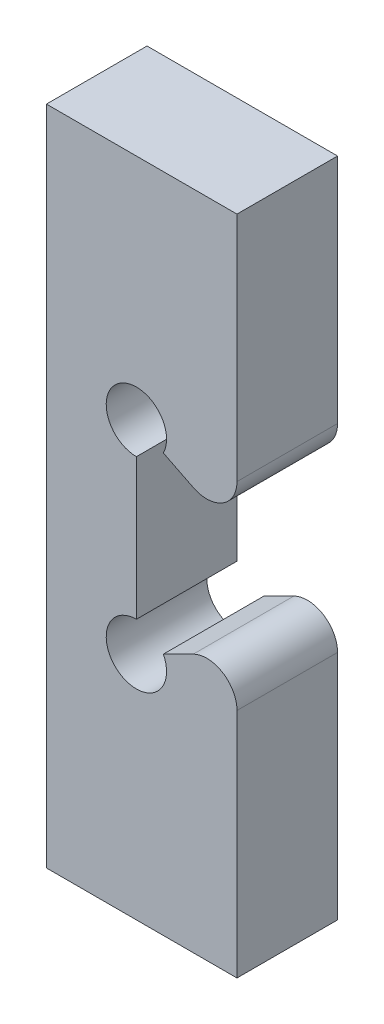
ISO-10303-21;
HEADER;
FILE_DESCRIPTION(('STEP AP214'),'2;1');
FILE_NAME('part.step','',(''),(''),'','','');
FILE_SCHEMA(('AUTOMOTIVE_DESIGN { 1 0 10303 214 1 1 1 1 }'));
ENDSEC;
DATA;
#1=APPLICATION_CONTEXT('core data for automotive mechanical design processes');
#2=APPLICATION_PROTOCOL_DEFINITION('international standard','automotive_design',2000,#1);
#3=PRODUCT_CONTEXT('',#1,'mechanical');
#4=PRODUCT('Part','Part','',(#3));
#5=PRODUCT_RELATED_PRODUCT_CATEGORY('part','',(#4));
#6=PRODUCT_DEFINITION_FORMATION('','',#4);
#7=PRODUCT_DEFINITION_CONTEXT('part definition',#1,'design');
#8=PRODUCT_DEFINITION('design','',#6,#7);
#9=PRODUCT_DEFINITION_SHAPE('','',#8);
#10=(LENGTH_UNIT() NAMED_UNIT(*) SI_UNIT(.MILLI.,.METRE.));
#11=(NAMED_UNIT(*) PLANE_ANGLE_UNIT() SI_UNIT($,.RADIAN.));
#12=(NAMED_UNIT(*) SI_UNIT($,.STERADIAN.) SOLID_ANGLE_UNIT());
#13=UNCERTAINTY_MEASURE_WITH_UNIT(LENGTH_MEASURE(1.E-05),#10,'distance_accuracy_value','');
#14=(GEOMETRIC_REPRESENTATION_CONTEXT(3) GLOBAL_UNCERTAINTY_ASSIGNED_CONTEXT((#13)) GLOBAL_UNIT_ASSIGNED_CONTEXT((#10,
#11,#12)) REPRESENTATION_CONTEXT('',''));
#15=CARTESIAN_POINT('',(0.,0.,0.));
#16=DIRECTION('',(0.,0.,1.));
#17=DIRECTION('',(1.,0.,0.));
#18=AXIS2_PLACEMENT_3D('',#15,#16,#17);
#19=CARTESIAN_POINT('',(-69.,4.15760929328095,-39.2215193998031));
#20=DIRECTION('',(0.,0.,1.));
#21=DIRECTION('',(1.,0.,0.));
#22=AXIS2_PLACEMENT_3D('',#19,#20,#21);
#23=CYLINDRICAL_SURFACE('',#22,1.5);
#24=CARTESIAN_POINT('',(-69.,4.15760929328095,-5.));
#25=DIRECTION('',(0.,0.,1.));
#26=DIRECTION('',(1.,0.,0.));
#27=AXIS2_PLACEMENT_3D('',#24,#25,#26);
#28=CIRCLE('',#27,1.5);
#29=CARTESIAN_POINT('',(-69.,5.65760929328095,-5.));
#30=VERTEX_POINT('',#29);
#31=CARTESIAN_POINT('',(-67.6583592135001,4.82842968653089,-5.));
#32=VERTEX_POINT('',#31);
#33=EDGE_CURVE('E46',#30,#32,#28,.T.);
#34=ORIENTED_EDGE('',*,*,#33,.F.);
#35=DIRECTION('',(0.,0.,1.));
#36=VECTOR('',#35,1.);
#37=CARTESIAN_POINT('',(-69.,5.65760929328095,-39.2215193998031));
#38=LINE('',#37,#36);
#39=CARTESIAN_POINT('',(-69.,5.65760929328095,0.));
#40=VERTEX_POINT('',#39);
#41=EDGE_CURVE('E125',#30,#40,#38,.T.);
#42=ORIENTED_EDGE('',*,*,#41,.T.);
#43=CARTESIAN_POINT('',(-69.,4.15760929328095,0.));
#44=DIRECTION('',(0.,0.,-1.));
#45=DIRECTION('',(1.,0.,0.));
#46=AXIS2_PLACEMENT_3D('',#43,#44,#45);
#47=CIRCLE('',#46,1.5);
#48=CARTESIAN_POINT('',(-67.6583592135001,4.82842968653089,0.));
#49=VERTEX_POINT('',#48);
#50=EDGE_CURVE('E129',#49,#40,#47,.T.);
#51=ORIENTED_EDGE('',*,*,#50,.F.);
#52=DIRECTION('',(0.,0.,1.));
#53=VECTOR('',#52,1.);
#54=CARTESIAN_POINT('',(-67.6583592135001,4.82842968653089,-39.2215193998031));
#55=LINE('',#54,#53);
#56=EDGE_CURVE('E176',#32,#49,#55,.T.);
#57=ORIENTED_EDGE('',*,*,#56,.F.);
#58=EDGE_LOOP('',(#34,#42,#51,#57));
#59=FACE_BOUND('',#58,.T.);
#60=ADVANCED_FACE('F39',(#59),#23,.F.);
#61=CARTESIAN_POINT('',(-67.6583592135001,4.82842968653089,-39.2215193998031));
#62=DIRECTION('',(-0.447213595499957,0.894427190999916,0.));
#63=DIRECTION('',(-0.894427190999916,-0.447213595499957,0.));
#64=AXIS2_PLACEMENT_3D('',#61,#62,#63);
#65=PLANE('',#64);
#66=DIRECTION('',(0.894427190999916,0.447213595499957,0.));
#67=VECTOR('',#66,1.);
#68=CARTESIAN_POINT('',(-67.6583592135001,4.82842968653089,-5.));
#69=LINE('',#68,#67);
#70=CARTESIAN_POINT('',(-66.17082039325,5.57219909665597,-5.));
#71=VERTEX_POINT('',#70);
#72=EDGE_CURVE('E242',#32,#71,#69,.T.);
#73=ORIENTED_EDGE('',*,*,#72,.F.);
#74=ORIENTED_EDGE('',*,*,#56,.T.);
#75=DIRECTION('',(-0.894427190999916,-0.447213595499957,0.));
#76=VECTOR('',#75,1.);
#77=CARTESIAN_POINT('',(-67.6583592135001,4.82842968653089,0.));
#78=LINE('',#77,#76);
#79=CARTESIAN_POINT('',(-66.17082039325,5.57219909665597,0.));
#80=VERTEX_POINT('',#79);
#81=EDGE_CURVE('E134',#80,#49,#78,.T.);
#82=ORIENTED_EDGE('',*,*,#81,.F.);
#83=DIRECTION('',(0.,0.,1.));
#84=VECTOR('',#83,1.);
#85=CARTESIAN_POINT('',(-66.17082039325,5.57219909665597,-39.2215193998031));
#86=LINE('',#85,#84);
#87=EDGE_CURVE('E179',#71,#80,#86,.T.);
#88=ORIENTED_EDGE('',*,*,#87,.F.);
#89=EDGE_LOOP('',(#73,#74,#82,#88));
#90=FACE_BOUND('',#89,.T.);
#91=ADVANCED_FACE('F241',(#90),#65,.T.);
#92=CARTESIAN_POINT('',(-65.5,4.2305583101561,-39.2215193998031));
#93=DIRECTION('',(0.,0.,1.));
#94=DIRECTION('',(1.,0.,0.));
#95=AXIS2_PLACEMENT_3D('',#92,#93,#94);
#96=CYLINDRICAL_SURFACE('',#95,1.5);
#97=CARTESIAN_POINT('',(-65.5,4.2305583101561,-5.));
#98=DIRECTION('',(0.,0.,1.));
#99=DIRECTION('',(1.,0.,0.));
#100=AXIS2_PLACEMENT_3D('',#97,#98,#99);
#101=CIRCLE('',#100,1.5);
#102=CARTESIAN_POINT('',(-64.,4.23055831015609,-5.));
#103=VERTEX_POINT('',#102);
#104=EDGE_CURVE('E244',#71,#103,#101,.F.);
#105=ORIENTED_EDGE('',*,*,#104,.F.);
#106=ORIENTED_EDGE('',*,*,#87,.T.);
#107=CARTESIAN_POINT('',(-65.5,4.2305583101561,0.));
#108=DIRECTION('',(0.,0.,1.));
#109=DIRECTION('',(1.,0.,0.));
#110=AXIS2_PLACEMENT_3D('',#107,#108,#109);
#111=CIRCLE('',#110,1.5);
#112=CARTESIAN_POINT('',(-64.,4.23055831015609,0.));
#113=VERTEX_POINT('',#112);
#114=EDGE_CURVE('E173',#113,#80,#111,.T.);
#115=ORIENTED_EDGE('',*,*,#114,.F.);
#116=DIRECTION('',(0.,0.,1.));
#117=VECTOR('',#116,1.);
#118=CARTESIAN_POINT('',(-64.,4.23055831015609,-39.2215193998031));
#119=LINE('',#118,#117);
#120=EDGE_CURVE('E181',#103,#113,#119,.T.);
#121=ORIENTED_EDGE('',*,*,#120,.F.);
#122=EDGE_LOOP('',(#105,#106,#115,#121));
#123=FACE_BOUND('',#122,.T.);
#124=ADVANCED_FACE('F267',(#123),#96,.T.);
#125=CARTESIAN_POINT('',(-64.,4.23055831015609,-39.2215193998031));
#126=DIRECTION('',(1.,0.,0.));
#127=DIRECTION('',(0.,0.,-1.));
#128=AXIS2_PLACEMENT_3D('',#125,#126,#127);
#129=PLANE('',#128);
#130=DIRECTION('',(0.,-1.,0.));
#131=VECTOR('',#130,1.);
#132=CARTESIAN_POINT('',(-64.,4.23055831015609,-5.));
#133=LINE('',#132,#131);
#134=CARTESIAN_POINT('',(-64.,-7.2847814134381,-5.));
#135=VERTEX_POINT('',#134);
#136=EDGE_CURVE('E245',#103,#135,#133,.T.);
#137=ORIENTED_EDGE('',*,*,#136,.F.);
#138=ORIENTED_EDGE('',*,*,#120,.T.);
#139=DIRECTION('',(0.,1.,0.));
#140=VECTOR('',#139,1.);
#141=CARTESIAN_POINT('',(-64.,4.23055831015609,0.));
#142=LINE('',#141,#140);
#143=CARTESIAN_POINT('',(-64.,-7.2847814134381,0.));
#144=VERTEX_POINT('',#143);
#145=EDGE_CURVE('E170',#144,#113,#142,.T.);
#146=ORIENTED_EDGE('',*,*,#145,.F.);
#147=DIRECTION('',(0.,0.,1.));
#148=VECTOR('',#147,1.);
#149=CARTESIAN_POINT('',(-64.,-7.2847814134381,-39.2215193998031));
#150=LINE('',#149,#148);
#151=EDGE_CURVE('E183',#135,#144,#150,.T.);
#152=ORIENTED_EDGE('',*,*,#151,.F.);
#153=EDGE_LOOP('',(#137,#138,#146,#152));
#154=FACE_BOUND('',#153,.T.);
#155=ADVANCED_FACE('F234',(#154),#129,.T.);
#156=CARTESIAN_POINT('',(-73.4711953533595,-7.2847814134381,-39.2215193998031));
#157=DIRECTION('',(0.,-1.,0.));
#158=DIRECTION('',(0.,0.,-1.));
#159=AXIS2_PLACEMENT_3D('',#156,#157,#158);
#160=PLANE('',#159);
#161=DIRECTION('',(-1.,0.,0.));
#162=VECTOR('',#161,1.);
#163=CARTESIAN_POINT('',(-73.4711953533595,-7.2847814134381,-5.));
#164=LINE('',#163,#162);
#165=CARTESIAN_POINT('',(-73.4711953533595,-7.2847814134381,-5.));
#166=VERTEX_POINT('',#165);
#167=EDGE_CURVE('E231',#135,#166,#164,.T.);
#168=ORIENTED_EDGE('',*,*,#167,.F.);
#169=ORIENTED_EDGE('',*,*,#151,.T.);
#170=DIRECTION('',(1.,0.,0.));
#171=VECTOR('',#170,1.);
#172=CARTESIAN_POINT('',(-73.4711953533595,-7.2847814134381,0.));
#173=LINE('',#172,#171);
#174=CARTESIAN_POINT('',(-73.4711953533595,-7.2847814134381,0.));
#175=VERTEX_POINT('',#174);
#176=EDGE_CURVE('E167',#175,#144,#173,.T.);
#177=ORIENTED_EDGE('',*,*,#176,.F.);
#178=DIRECTION('',(0.,0.,1.));
#179=VECTOR('',#178,1.);
#180=CARTESIAN_POINT('',(-73.4711953533595,-7.2847814134381,-39.2215193998031));
#181=LINE('',#180,#179);
#182=EDGE_CURVE('E185',#166,#175,#181,.T.);
#183=ORIENTED_EDGE('',*,*,#182,.F.);
#184=EDGE_LOOP('',(#168,#169,#177,#183));
#185=FACE_BOUND('',#184,.T.);
#186=ADVANCED_FACE('F228',(#185),#160,.T.);
#187=CARTESIAN_POINT('',(-73.4711953533595,25.6,-39.2215193998031));
#188=DIRECTION('',(-1.,0.,0.));
#189=DIRECTION('',(0.,0.,1.));
#190=AXIS2_PLACEMENT_3D('',#187,#188,#189);
#191=PLANE('',#190);
#192=DIRECTION('',(0.,1.,0.));
#193=VECTOR('',#192,1.);
#194=CARTESIAN_POINT('',(-73.4711953533595,25.6,-5.));
#195=LINE('',#194,#193);
#196=CARTESIAN_POINT('',(-73.4711953533595,25.6,-5.));
#197=VERTEX_POINT('',#196);
#198=EDGE_CURVE('E225',#166,#197,#195,.T.);
#199=ORIENTED_EDGE('',*,*,#198,.F.);
#200=ORIENTED_EDGE('',*,*,#182,.T.);
#201=DIRECTION('',(0.,-1.,0.));
#202=VECTOR('',#201,1.);
#203=CARTESIAN_POINT('',(-73.4711953533595,25.6,0.));
#204=LINE('',#203,#202);
#205=CARTESIAN_POINT('',(-73.4711953533595,25.6,0.));
#206=VERTEX_POINT('',#205);
#207=EDGE_CURVE('E164',#206,#175,#204,.T.);
#208=ORIENTED_EDGE('',*,*,#207,.F.);
#209=DIRECTION('',(0.,0.,1.));
#210=VECTOR('',#209,1.);
#211=CARTESIAN_POINT('',(-73.4711953533595,25.6,-39.2215193998031));
#212=LINE('',#211,#210);
#213=EDGE_CURVE('E187',#197,#206,#212,.T.);
#214=ORIENTED_EDGE('',*,*,#213,.F.);
#215=EDGE_LOOP('',(#199,#200,#208,#214));
#216=FACE_BOUND('',#215,.T.);
#217=ADVANCED_FACE('F223',(#216),#191,.T.);
#218=CARTESIAN_POINT('',(-64.,25.6,-39.2215193998031));
#219=DIRECTION('',(0.,1.,0.));
#220=DIRECTION('',(0.,0.,1.));
#221=AXIS2_PLACEMENT_3D('',#218,#219,#220);
#222=PLANE('',#221);
#223=DIRECTION('',(1.,0.,0.));
#224=VECTOR('',#223,1.);
#225=CARTESIAN_POINT('',(-64.,25.6,-5.));
#226=LINE('',#225,#224);
#227=CARTESIAN_POINT('',(-64.,25.6,-5.));
#228=VERTEX_POINT('',#227);
#229=EDGE_CURVE('E251',#197,#228,#226,.T.);
#230=ORIENTED_EDGE('',*,*,#229,.F.);
#231=ORIENTED_EDGE('',*,*,#213,.T.);
#232=DIRECTION('',(-1.,0.,0.));
#233=VECTOR('',#232,1.);
#234=CARTESIAN_POINT('',(-64.,25.6,0.));
#235=LINE('',#234,#233);
#236=CARTESIAN_POINT('',(-64.,25.6,0.));
#237=VERTEX_POINT('',#236);
#238=EDGE_CURVE('E161',#237,#206,#235,.T.);
#239=ORIENTED_EDGE('',*,*,#238,.F.);
#240=DIRECTION('',(0.,0.,1.));
#241=VECTOR('',#240,1.);
#242=CARTESIAN_POINT('',(-64.,25.6,-39.2215193998031));
#243=LINE('',#242,#241);
#244=EDGE_CURVE('E189',#228,#237,#243,.T.);
#245=ORIENTED_EDGE('',*,*,#244,.F.);
#246=EDGE_LOOP('',(#230,#231,#239,#245));
#247=FACE_BOUND('',#246,.T.);
#248=ADVANCED_FACE('F217',(#247),#222,.T.);
#249=CARTESIAN_POINT('',(-64.,25.6,-39.2215193998031));
#250=DIRECTION('',(1.,0.,0.));
#251=DIRECTION('',(0.,0.,-1.));
#252=AXIS2_PLACEMENT_3D('',#249,#250,#251);
#253=PLANE('',#252);
#254=DIRECTION('',(0.,-1.,0.));
#255=VECTOR('',#254,1.);
#256=CARTESIAN_POINT('',(-64.,25.6,-5.));
#257=LINE('',#256,#255);
#258=CARTESIAN_POINT('',(-64.,14.0846602764058,-5.));
#259=VERTEX_POINT('',#258);
#260=EDGE_CURVE('E214',#228,#259,#257,.T.);
#261=ORIENTED_EDGE('',*,*,#260,.F.);
#262=ORIENTED_EDGE('',*,*,#244,.T.);
#263=DIRECTION('',(0.,1.,0.));
#264=VECTOR('',#263,1.);
#265=CARTESIAN_POINT('',(-64.,25.6,0.));
#266=LINE('',#265,#264);
#267=CARTESIAN_POINT('',(-64.,14.0846602764058,0.));
#268=VERTEX_POINT('',#267);
#269=EDGE_CURVE('E158',#268,#237,#266,.T.);
#270=ORIENTED_EDGE('',*,*,#269,.F.);
#271=DIRECTION('',(0.,0.,1.));
#272=VECTOR('',#271,1.);
#273=CARTESIAN_POINT('',(-64.,14.0846602764058,-39.2215193998031));
#274=LINE('',#273,#272);
#275=EDGE_CURVE('E191',#259,#268,#274,.T.);
#276=ORIENTED_EDGE('',*,*,#275,.F.);
#277=EDGE_LOOP('',(#261,#262,#270,#276));
#278=FACE_BOUND('',#277,.T.);
#279=ADVANCED_FACE('F211',(#278),#253,.T.);
#280=CARTESIAN_POINT('',(-65.5,14.0846602764058,-39.2215193998031));
#281=DIRECTION('',(0.,0.,1.));
#282=DIRECTION('',(1.,0.,0.));
#283=AXIS2_PLACEMENT_3D('',#280,#281,#282);
#284=CYLINDRICAL_SURFACE('',#283,1.5);
#285=CARTESIAN_POINT('',(-65.5,14.0846602764058,-5.));
#286=DIRECTION('',(0.,0.,1.));
#287=DIRECTION('',(1.,0.,0.));
#288=AXIS2_PLACEMENT_3D('',#285,#286,#287);
#289=CIRCLE('',#288,1.5);
#290=CARTESIAN_POINT('',(-66.17082039325,12.7430194899059,-5.));
#291=VERTEX_POINT('',#290);
#292=EDGE_CURVE('E58',#259,#291,#289,.F.);
#293=ORIENTED_EDGE('',*,*,#292,.F.);
#294=ORIENTED_EDGE('',*,*,#275,.T.);
#295=CARTESIAN_POINT('',(-65.5,14.0846602764058,0.));
#296=DIRECTION('',(0.,0.,1.));
#297=DIRECTION('',(-1.,0.,0.));
#298=AXIS2_PLACEMENT_3D('',#295,#296,#297);
#299=CIRCLE('',#298,1.5);
#300=CARTESIAN_POINT('',(-66.17082039325,12.7430194899059,0.));
#301=VERTEX_POINT('',#300);
#302=EDGE_CURVE('E155',#301,#268,#299,.T.);
#303=ORIENTED_EDGE('',*,*,#302,.F.);
#304=DIRECTION('',(0.,0.,1.));
#305=VECTOR('',#304,1.);
#306=CARTESIAN_POINT('',(-66.17082039325,12.7430194899059,-39.2215193998031));
#307=LINE('',#306,#305);
#308=EDGE_CURVE('E193',#291,#301,#307,.T.);
#309=ORIENTED_EDGE('',*,*,#308,.F.);
#310=EDGE_LOOP('',(#293,#294,#303,#309));
#311=FACE_BOUND('',#310,.T.);
#312=ADVANCED_FACE('F207',(#311),#284,.T.);
#313=CARTESIAN_POINT('',(-66.17082039325,12.7430194899059,-39.2215193998031));
#314=DIRECTION('',(-0.447213595499959,-0.894427190999915,0.));
#315=DIRECTION('',(0.894427190999916,-0.447213595499959,0.));
#316=AXIS2_PLACEMENT_3D('',#313,#314,#315);
#317=PLANE('',#316);
#318=DIRECTION('',(-0.894427190999916,0.447213595499959,0.));
#319=VECTOR('',#318,1.);
#320=CARTESIAN_POINT('',(-66.17082039325,12.7430194899059,-5.));
#321=LINE('',#320,#319);
#322=CARTESIAN_POINT('',(-67.6583592135001,13.486788900031,-5.));
#323=VERTEX_POINT('',#322);
#324=EDGE_CURVE('E53',#291,#323,#321,.T.);
#325=ORIENTED_EDGE('',*,*,#324,.F.);
#326=ORIENTED_EDGE('',*,*,#308,.T.);
#327=DIRECTION('',(0.894427190999915,-0.447213595499959,0.));
#328=VECTOR('',#327,1.);
#329=CARTESIAN_POINT('',(-66.17082039325,12.7430194899059,0.));
#330=LINE('',#329,#328);
#331=CARTESIAN_POINT('',(-67.6583592135001,13.486788900031,0.));
#332=VERTEX_POINT('',#331);
#333=EDGE_CURVE('E152',#332,#301,#330,.T.);
#334=ORIENTED_EDGE('',*,*,#333,.F.);
#335=DIRECTION('',(0.,0.,1.));
#336=VECTOR('',#335,1.);
#337=CARTESIAN_POINT('',(-67.6583592135001,13.486788900031,-39.2215193998031));
#338=LINE('',#337,#336);
#339=EDGE_CURVE('E195',#323,#332,#338,.T.);
#340=ORIENTED_EDGE('',*,*,#339,.F.);
#341=EDGE_LOOP('',(#325,#326,#334,#340));
#342=FACE_BOUND('',#341,.T.);
#343=ADVANCED_FACE('F202',(#342),#317,.T.);
#344=CARTESIAN_POINT('',(-69.,14.157609293281,-39.2215193998031));
#345=DIRECTION('',(0.,0.,1.));
#346=DIRECTION('',(1.,0.,0.));
#347=AXIS2_PLACEMENT_3D('',#344,#345,#346);
#348=CYLINDRICAL_SURFACE('',#347,1.5);
#349=CARTESIAN_POINT('',(-69.,14.157609293281,-5.));
#350=DIRECTION('',(0.,0.,1.));
#351=DIRECTION('',(1.,0.,0.));
#352=AXIS2_PLACEMENT_3D('',#349,#350,#351);
#353=CIRCLE('',#352,1.5);
#354=CARTESIAN_POINT('',(-69.,12.657609293281,-5.));
#355=VERTEX_POINT('',#354);
#356=EDGE_CURVE('E178',#323,#355,#353,.T.);
#357=ORIENTED_EDGE('',*,*,#356,.F.);
#358=ORIENTED_EDGE('',*,*,#339,.T.);
#359=CARTESIAN_POINT('',(-69.,14.157609293281,0.));
#360=DIRECTION('',(0.,0.,-1.));
#361=DIRECTION('',(1.,0.,0.));
#362=AXIS2_PLACEMENT_3D('',#359,#360,#361);
#363=CIRCLE('',#362,1.5);
#364=CARTESIAN_POINT('',(-69.,12.657609293281,0.));
#365=VERTEX_POINT('',#364);
#366=EDGE_CURVE('E142',#365,#332,#363,.T.);
#367=ORIENTED_EDGE('',*,*,#366,.F.);
#368=DIRECTION('',(0.,0.,1.));
#369=VECTOR('',#368,1.);
#370=CARTESIAN_POINT('',(-69.,12.657609293281,-39.2215193998031));
#371=LINE('',#370,#369);
#372=EDGE_CURVE('E133',#355,#365,#371,.T.);
#373=ORIENTED_EDGE('',*,*,#372,.F.);
#374=EDGE_LOOP('',(#357,#358,#367,#373));
#375=FACE_BOUND('',#374,.T.);
#376=ADVANCED_FACE('F200',(#375),#348,.F.);
#377=CARTESIAN_POINT('',(-69.,12.657609293281,-39.2215193998031));
#378=DIRECTION('',(1.,0.,0.));
#379=DIRECTION('',(0.,1.,0.));
#380=AXIS2_PLACEMENT_3D('',#377,#378,#379);
#381=PLANE('',#380);
#382=DIRECTION('',(0.,-1.,0.));
#383=VECTOR('',#382,1.);
#384=CARTESIAN_POINT('',(-69.,12.657609293281,-5.));
#385=LINE('',#384,#383);
#386=EDGE_CURVE('E11',#355,#30,#385,.T.);
#387=ORIENTED_EDGE('',*,*,#386,.F.);
#388=ORIENTED_EDGE('',*,*,#372,.T.);
#389=DIRECTION('',(0.,1.,0.));
#390=VECTOR('',#389,1.);
#391=CARTESIAN_POINT('',(-69.,12.657609293281,0.));
#392=LINE('',#391,#390);
#393=EDGE_CURVE('E136',#40,#365,#392,.T.);
#394=ORIENTED_EDGE('',*,*,#393,.F.);
#395=ORIENTED_EDGE('',*,*,#41,.F.);
#396=EDGE_LOOP('',(#387,#388,#394,#395));
#397=FACE_BOUND('',#396,.T.);
#398=ADVANCED_FACE('F137',(#397),#381,.T.);
#399=CARTESIAN_POINT('',(-69.,4.15760929328095,0.));
#400=DIRECTION('',(0.,0.,1.));
#401=DIRECTION('',(1.,0.,0.));
#402=AXIS2_PLACEMENT_3D('',#399,#400,#401);
#403=PLANE('',#402);
#404=ORIENTED_EDGE('',*,*,#50,.T.);
#405=ORIENTED_EDGE('',*,*,#393,.T.);
#406=ORIENTED_EDGE('',*,*,#366,.T.);
#407=ORIENTED_EDGE('',*,*,#333,.T.);
#408=ORIENTED_EDGE('',*,*,#302,.T.);
#409=ORIENTED_EDGE('',*,*,#269,.T.);
#410=ORIENTED_EDGE('',*,*,#238,.T.);
#411=ORIENTED_EDGE('',*,*,#207,.T.);
#412=ORIENTED_EDGE('',*,*,#176,.T.);
#413=ORIENTED_EDGE('',*,*,#145,.T.);
#414=ORIENTED_EDGE('',*,*,#114,.T.);
#415=ORIENTED_EDGE('',*,*,#81,.T.);
#416=EDGE_LOOP('',(#404,#405,#406,#407,#408,#409,#410,#411,#412,#413,#414,#415));
#417=FACE_BOUND('',#416,.T.);
#418=ADVANCED_FACE('F144',(#417),#403,.T.);
#419=CARTESIAN_POINT('',(0.,0.,-5.));
#420=DIRECTION('',(0.,0.,1.));
#421=DIRECTION('',(1.,0.,0.));
#422=AXIS2_PLACEMENT_3D('',#419,#420,#421);
#423=PLANE('',#422);
#424=ORIENTED_EDGE('',*,*,#33,.T.);
#425=ORIENTED_EDGE('',*,*,#72,.T.);
#426=ORIENTED_EDGE('',*,*,#104,.T.);
#427=ORIENTED_EDGE('',*,*,#136,.T.);
#428=ORIENTED_EDGE('',*,*,#167,.T.);
#429=ORIENTED_EDGE('',*,*,#198,.T.);
#430=ORIENTED_EDGE('',*,*,#229,.T.);
#431=ORIENTED_EDGE('',*,*,#260,.T.);
#432=ORIENTED_EDGE('',*,*,#292,.T.);
#433=ORIENTED_EDGE('',*,*,#324,.T.);
#434=ORIENTED_EDGE('',*,*,#356,.T.);
#435=ORIENTED_EDGE('',*,*,#386,.T.);
#436=EDGE_LOOP('',(#424,#425,#426,#427,#428,#429,#430,#431,#432,#433,#434,#435));
#437=FACE_BOUND('',#436,.T.);
#438=ADVANCED_FACE('F256',(#437),#423,.F.);
#439=CLOSED_SHELL('',(#60,#91,#124,#155,#186,#217,#248,#279,#312,#343,#376,#398,#418,#438));
#440=MANIFOLD_SOLID_BREP('B2',#439);
#441=ADVANCED_BREP_SHAPE_REPRESENTATION('',(#18,#440),#14);
#442=SHAPE_DEFINITION_REPRESENTATION(#9,#441);
ENDSEC;
END-ISO-10303-21;
